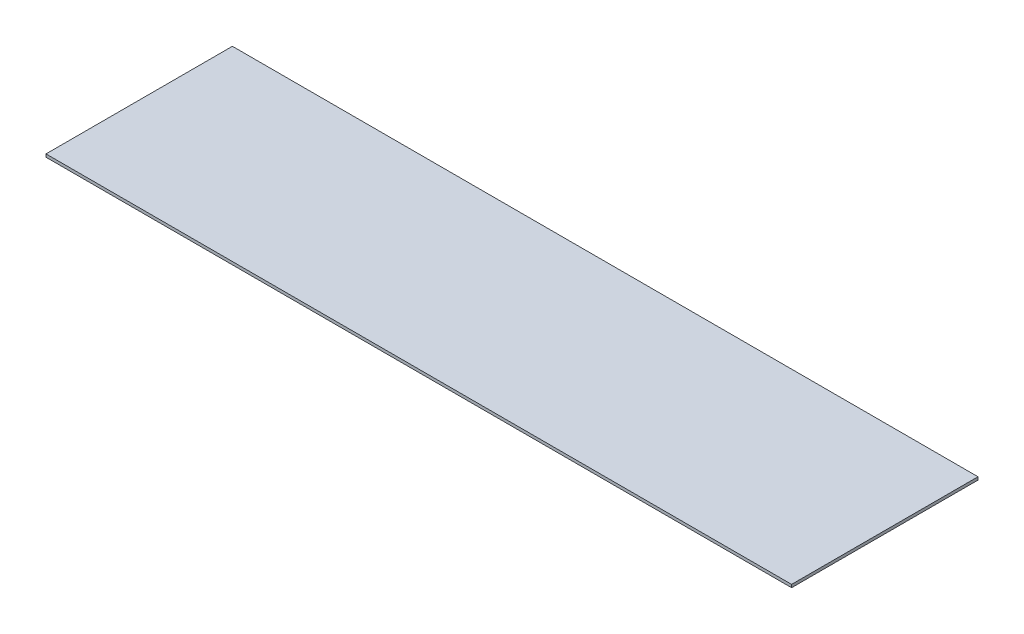
ISO-10303-21;
HEADER;
FILE_DESCRIPTION(('STEP AP214'),'2;1');
FILE_NAME('part.step','',(''),(''),'','','');
FILE_SCHEMA(('AUTOMOTIVE_DESIGN { 1 0 10303 214 1 1 1 1 }'));
ENDSEC;
DATA;
#1=APPLICATION_CONTEXT('core data for automotive mechanical design processes');
#2=APPLICATION_PROTOCOL_DEFINITION('international standard','automotive_design',2000,#1);
#3=PRODUCT_CONTEXT('',#1,'mechanical');
#4=PRODUCT('Part','Part','',(#3));
#5=PRODUCT_RELATED_PRODUCT_CATEGORY('part','',(#4));
#6=PRODUCT_DEFINITION_FORMATION('','',#4);
#7=PRODUCT_DEFINITION_CONTEXT('part definition',#1,'design');
#8=PRODUCT_DEFINITION('design','',#6,#7);
#9=PRODUCT_DEFINITION_SHAPE('','',#8);
#10=(LENGTH_UNIT() NAMED_UNIT(*) SI_UNIT(.MILLI.,.METRE.));
#11=(NAMED_UNIT(*) PLANE_ANGLE_UNIT() SI_UNIT($,.RADIAN.));
#12=(NAMED_UNIT(*) SI_UNIT($,.STERADIAN.) SOLID_ANGLE_UNIT());
#13=UNCERTAINTY_MEASURE_WITH_UNIT(LENGTH_MEASURE(1.E-05),#10,'distance_accuracy_value','');
#14=(GEOMETRIC_REPRESENTATION_CONTEXT(3) GLOBAL_UNCERTAINTY_ASSIGNED_CONTEXT((#13)) GLOBAL_UNIT_ASSIGNED_CONTEXT((#10,
#11,#12)) REPRESENTATION_CONTEXT('',''));
#15=CARTESIAN_POINT('',(0.,0.,0.));
#16=DIRECTION('',(0.,0.,1.));
#17=DIRECTION('',(1.,0.,0.));
#18=AXIS2_PLACEMENT_3D('',#15,#16,#17);
#19=CARTESIAN_POINT('',(0.,-81.849866020411,0.));
#20=DIRECTION('',(1.,0.,0.));
#21=DIRECTION('',(0.,0.,-1.));
#22=AXIS2_PLACEMENT_3D('',#19,#20,#21);
#23=PLANE('',#22);
#24=DIRECTION('',(0.,0.,-1.));
#25=VECTOR('',#24,1.);
#26=CARTESIAN_POINT('',(0.,-80.262366020411,0.));
#27=LINE('',#26,#25);
#28=CARTESIAN_POINT('',(0.,-80.262366020411,101.6));
#29=VERTEX_POINT('',#28);
#30=CARTESIAN_POINT('',(0.,-80.262366020411,0.));
#31=VERTEX_POINT('',#30);
#32=EDGE_CURVE('E99',#29,#31,#27,.T.);
#33=ORIENTED_EDGE('',*,*,#32,.T.);
#34=DIRECTION('',(0.,1.,0.));
#35=VECTOR('',#34,1.);
#36=CARTESIAN_POINT('',(0.,-81.849866020411,0.));
#37=LINE('',#36,#35);
#38=CARTESIAN_POINT('',(0.,-81.849866020411,0.));
#39=VERTEX_POINT('',#38);
#40=EDGE_CURVE('E11',#39,#31,#37,.T.);
#41=ORIENTED_EDGE('',*,*,#40,.F.);
#42=DIRECTION('',(0.,0.,-1.));
#43=VECTOR('',#42,1.);
#44=CARTESIAN_POINT('',(0.,-81.849866020411,0.));
#45=LINE('',#44,#43);
#46=CARTESIAN_POINT('',(0.,-81.849866020411,101.6));
#47=VERTEX_POINT('',#46);
#48=EDGE_CURVE('E87',#47,#39,#45,.T.);
#49=ORIENTED_EDGE('',*,*,#48,.F.);
#50=DIRECTION('',(0.,1.,0.));
#51=VECTOR('',#50,1.);
#52=CARTESIAN_POINT('',(0.,-81.849866020411,101.6));
#53=LINE('',#52,#51);
#54=EDGE_CURVE('E95',#47,#29,#53,.T.);
#55=ORIENTED_EDGE('',*,*,#54,.T.);
#56=EDGE_LOOP('',(#33,#41,#49,#55));
#57=FACE_BOUND('',#56,.T.);
#58=ADVANCED_FACE('F36',(#57),#23,.F.);
#59=CARTESIAN_POINT('',(0.,-81.849866020411,0.));
#60=DIRECTION('',(0.,0.,1.));
#61=DIRECTION('',(1.,0.,0.));
#62=AXIS2_PLACEMENT_3D('',#59,#60,#61);
#63=PLANE('',#62);
#64=DIRECTION('',(1.,0.,0.));
#65=VECTOR('',#64,1.);
#66=CARTESIAN_POINT('',(0.,-80.262366020411,0.));
#67=LINE('',#66,#65);
#68=CARTESIAN_POINT('',(406.4,-80.262366020411,0.));
#69=VERTEX_POINT('',#68);
#70=EDGE_CURVE('E91',#31,#69,#67,.T.);
#71=ORIENTED_EDGE('',*,*,#70,.T.);
#72=DIRECTION('',(0.,1.,0.));
#73=VECTOR('',#72,1.);
#74=CARTESIAN_POINT('',(406.4,-81.849866020411,0.));
#75=LINE('',#74,#73);
#76=CARTESIAN_POINT('',(406.4,-81.849866020411,0.));
#77=VERTEX_POINT('',#76);
#78=EDGE_CURVE('E44',#77,#69,#75,.T.);
#79=ORIENTED_EDGE('',*,*,#78,.F.);
#80=DIRECTION('',(1.,0.,0.));
#81=VECTOR('',#80,1.);
#82=CARTESIAN_POINT('',(0.,-81.849866020411,0.));
#83=LINE('',#82,#81);
#84=EDGE_CURVE('E82',#39,#77,#83,.T.);
#85=ORIENTED_EDGE('',*,*,#84,.F.);
#86=ORIENTED_EDGE('',*,*,#40,.T.);
#87=EDGE_LOOP('',(#71,#79,#85,#86));
#88=FACE_BOUND('',#87,.T.);
#89=ADVANCED_FACE('F90',(#88),#63,.F.);
#90=CARTESIAN_POINT('',(406.4,-81.849866020411,0.));
#91=DIRECTION('',(-1.,0.,0.));
#92=DIRECTION('',(0.,0.,1.));
#93=AXIS2_PLACEMENT_3D('',#90,#91,#92);
#94=PLANE('',#93);
#95=DIRECTION('',(0.,0.,1.));
#96=VECTOR('',#95,1.);
#97=CARTESIAN_POINT('',(406.4,-80.262366020411,0.));
#98=LINE('',#97,#96);
#99=CARTESIAN_POINT('',(406.4,-80.262366020411,101.6));
#100=VERTEX_POINT('',#99);
#101=EDGE_CURVE('E69',#69,#100,#98,.T.);
#102=ORIENTED_EDGE('',*,*,#101,.T.);
#103=DIRECTION('',(0.,1.,0.));
#104=VECTOR('',#103,1.);
#105=CARTESIAN_POINT('',(406.4,-81.849866020411,101.6));
#106=LINE('',#105,#104);
#107=CARTESIAN_POINT('',(406.4,-81.849866020411,101.6));
#108=VERTEX_POINT('',#107);
#109=EDGE_CURVE('E92',#108,#100,#106,.T.);
#110=ORIENTED_EDGE('',*,*,#109,.F.);
#111=DIRECTION('',(0.,0.,1.));
#112=VECTOR('',#111,1.);
#113=CARTESIAN_POINT('',(406.4,-81.849866020411,0.));
#114=LINE('',#113,#112);
#115=EDGE_CURVE('E85',#77,#108,#114,.T.);
#116=ORIENTED_EDGE('',*,*,#115,.F.);
#117=ORIENTED_EDGE('',*,*,#78,.T.);
#118=EDGE_LOOP('',(#102,#110,#116,#117));
#119=FACE_BOUND('',#118,.T.);
#120=ADVANCED_FACE('F93',(#119),#94,.F.);
#121=CARTESIAN_POINT('',(0.,-81.849866020411,101.6));
#122=DIRECTION('',(0.,0.,-1.));
#123=DIRECTION('',(-1.,0.,0.));
#124=AXIS2_PLACEMENT_3D('',#121,#122,#123);
#125=PLANE('',#124);
#126=DIRECTION('',(-1.,0.,0.));
#127=VECTOR('',#126,1.);
#128=CARTESIAN_POINT('',(0.,-80.262366020411,101.6));
#129=LINE('',#128,#127);
#130=EDGE_CURVE('E75',#100,#29,#129,.T.);
#131=ORIENTED_EDGE('',*,*,#130,.T.);
#132=ORIENTED_EDGE('',*,*,#54,.F.);
#133=DIRECTION('',(-1.,0.,0.));
#134=VECTOR('',#133,1.);
#135=CARTESIAN_POINT('',(0.,-81.849866020411,101.6));
#136=LINE('',#135,#134);
#137=EDGE_CURVE('E52',#108,#47,#136,.T.);
#138=ORIENTED_EDGE('',*,*,#137,.F.);
#139=ORIENTED_EDGE('',*,*,#109,.T.);
#140=EDGE_LOOP('',(#131,#132,#138,#139));
#141=FACE_BOUND('',#140,.T.);
#142=ADVANCED_FACE('F106',(#141),#125,.F.);
#143=CARTESIAN_POINT('',(0.,-81.849866020411,0.));
#144=DIRECTION('',(0.,1.,0.));
#145=DIRECTION('',(0.,0.,1.));
#146=AXIS2_PLACEMENT_3D('',#143,#144,#145);
#147=PLANE('',#146);
#148=ORIENTED_EDGE('',*,*,#48,.T.);
#149=ORIENTED_EDGE('',*,*,#84,.T.);
#150=ORIENTED_EDGE('',*,*,#115,.T.);
#151=ORIENTED_EDGE('',*,*,#137,.T.);
#152=EDGE_LOOP('',(#148,#149,#150,#151));
#153=FACE_BOUND('',#152,.T.);
#154=ADVANCED_FACE('F83',(#153),#147,.F.);
#155=CARTESIAN_POINT('',(0.,-80.262366020411,0.));
#156=DIRECTION('',(0.,1.,0.));
#157=DIRECTION('',(0.,0.,1.));
#158=AXIS2_PLACEMENT_3D('',#155,#156,#157);
#159=PLANE('',#158);
#160=ORIENTED_EDGE('',*,*,#32,.F.);
#161=ORIENTED_EDGE('',*,*,#130,.F.);
#162=ORIENTED_EDGE('',*,*,#101,.F.);
#163=ORIENTED_EDGE('',*,*,#70,.F.);
#164=EDGE_LOOP('',(#160,#161,#162,#163));
#165=FACE_BOUND('',#164,.T.);
#166=ADVANCED_FACE('F109',(#165),#159,.T.);
#167=CLOSED_SHELL('',(#58,#89,#120,#142,#154,#166));
#168=MANIFOLD_SOLID_BREP('B2',#167);
#169=ADVANCED_BREP_SHAPE_REPRESENTATION('',(#18,#168),#14);
#170=SHAPE_DEFINITION_REPRESENTATION(#9,#169);
ENDSEC;
END-ISO-10303-21;
